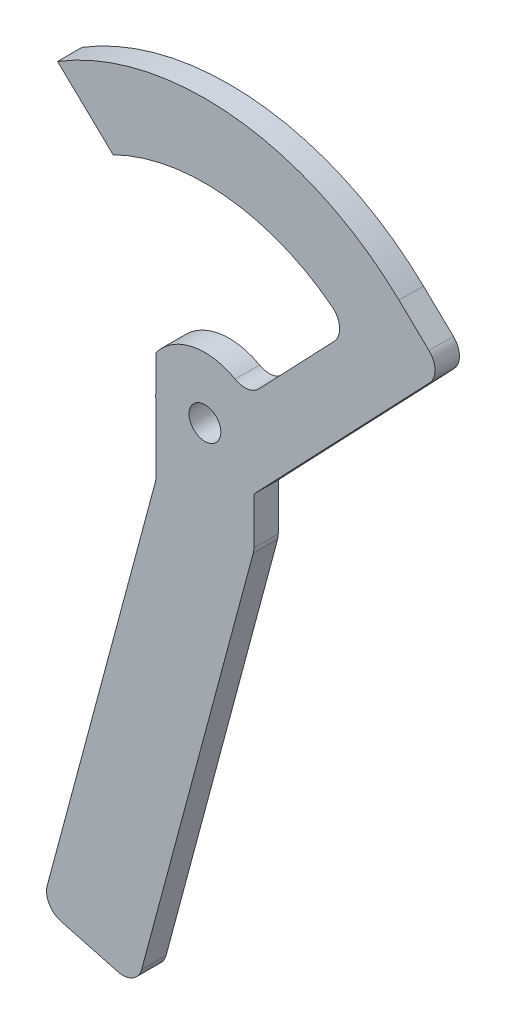
ISO-10303-21;
HEADER;
FILE_DESCRIPTION(('STEP AP214'),'2;1');
FILE_NAME('part.step','',(''),(''),'','','');
FILE_SCHEMA(('AUTOMOTIVE_DESIGN { 1 0 10303 214 1 1 1 1 }'));
ENDSEC;
DATA;
#1=APPLICATION_CONTEXT('core data for automotive mechanical design processes');
#2=APPLICATION_PROTOCOL_DEFINITION('international standard','automotive_design',2000,#1);
#3=PRODUCT_CONTEXT('',#1,'mechanical');
#4=PRODUCT('Part','Part','',(#3));
#5=PRODUCT_RELATED_PRODUCT_CATEGORY('part','',(#4));
#6=PRODUCT_DEFINITION_FORMATION('','',#4);
#7=PRODUCT_DEFINITION_CONTEXT('part definition',#1,'design');
#8=PRODUCT_DEFINITION('design','',#6,#7);
#9=PRODUCT_DEFINITION_SHAPE('','',#8);
#10=(LENGTH_UNIT() NAMED_UNIT(*) SI_UNIT(.MILLI.,.METRE.));
#11=(NAMED_UNIT(*) PLANE_ANGLE_UNIT() SI_UNIT($,.RADIAN.));
#12=(NAMED_UNIT(*) SI_UNIT($,.STERADIAN.) SOLID_ANGLE_UNIT());
#13=UNCERTAINTY_MEASURE_WITH_UNIT(LENGTH_MEASURE(1.E-05),#10,'distance_accuracy_value','');
#14=(GEOMETRIC_REPRESENTATION_CONTEXT(3) GLOBAL_UNCERTAINTY_ASSIGNED_CONTEXT((#13)) GLOBAL_UNIT_ASSIGNED_CONTEXT((#10,
#11,#12)) REPRESENTATION_CONTEXT('',''));
#15=CARTESIAN_POINT('',(0.,0.,0.));
#16=DIRECTION('',(0.,0.,1.));
#17=DIRECTION('',(1.,0.,0.));
#18=AXIS2_PLACEMENT_3D('',#15,#16,#17);
#19=CARTESIAN_POINT('',(0.,0.,5.));
#20=DIRECTION('',(0.,0.,1.));
#21=DIRECTION('',(1.,0.,0.));
#22=AXIS2_PLACEMENT_3D('',#19,#20,#21);
#23=PLANE('',#22);
#24=DIRECTION('',(0.,-1.,0.));
#25=VECTOR('',#24,1.);
#26=CARTESIAN_POINT('',(294.71531691805,0.,5.));
#27=LINE('',#26,#25);
#28=CARTESIAN_POINT('',(294.71531691805,230.119674969828,5.));
#29=VERTEX_POINT('',#28);
#30=CARTESIAN_POINT('',(294.71531691805,222.972135785085,5.));
#31=VERTEX_POINT('',#30);
#32=EDGE_CURVE('E268',#29,#31,#27,.T.);
#33=ORIENTED_EDGE('',*,*,#32,.T.);
#34=CARTESIAN_POINT('',(296.717620536532,222.427704688054,5.));
#35=DIRECTION('',(0.,0.,1.));
#36=DIRECTION('',(1.,0.,0.));
#37=AXIS2_PLACEMENT_3D('',#34,#35,#36);
#38=CIRCLE('',#37,2.07499999999998);
#39=CARTESIAN_POINT('',(294.643218037577,222.377912396209,5.));
#40=VERTEX_POINT('',#39);
#41=EDGE_CURVE('E216',#31,#40,#38,.T.);
#42=ORIENTED_EDGE('',*,*,#41,.T.);
#43=CARTESIAN_POINT('',(304.715316918032,222.61967496975,5.));
#44=DIRECTION('',(0.,0.,1.));
#45=DIRECTION('',(1.,0.,0.));
#46=AXIS2_PLACEMENT_3D('',#43,#44,#45);
#47=CIRCLE('',#46,10.074999999985);
#48=CARTESIAN_POINT('',(294.71531691805,221.392635850547,5.));
#49=VERTEX_POINT('',#48);
#50=EDGE_CURVE('E232',#40,#49,#47,.T.);
#51=ORIENTED_EDGE('',*,*,#50,.T.);
#52=CARTESIAN_POINT('',(294.71531691805,208.1462849601,5.));
#53=VERTEX_POINT('',#52);
#54=EDGE_CURVE('E263',#49,#53,#27,.T.);
#55=ORIENTED_EDGE('',*,*,#54,.T.);
#56=CARTESIAN_POINT('',(290.71531691805,208.146284960133,5.));
#57=DIRECTION('',(0.,0.,1.));
#58=DIRECTION('',(1.,0.,0.));
#59=AXIS2_PLACEMENT_3D('',#56,#57,#58);
#60=CIRCLE('',#59,4.00000000000006);
#61=CARTESIAN_POINT('',(294.5790202232,207.1110087797,5.));
#62=VERTEX_POINT('',#61);
#63=EDGE_CURVE('E271',#62,#53,#60,.T.);
#64=ORIENTED_EDGE('',*,*,#63,.F.);
#65=DIRECTION('',(-0.258819045102268,-0.965925826289136,0.));
#66=VECTOR('',#65,1.);
#67=CARTESIAN_POINT('',(223.068215384371,-59.7709481692314,5.));
#68=LINE('',#67,#66);
#69=CARTESIAN_POINT('',(272.45687903925,124.5500539089,5.));
#70=VERTEX_POINT('',#69);
#71=EDGE_CURVE('E277',#62,#70,#68,.T.);
#72=ORIENTED_EDGE('',*,*,#71,.T.);
#73=CARTESIAN_POINT('',(276.320582344411,123.514777728506,5.));
#74=DIRECTION('',(0.,0.,1.));
#75=DIRECTION('',(1.,0.,0.));
#76=AXIS2_PLACEMENT_3D('',#73,#74,#75);
#77=CIRCLE('',#76,4.);
#78=CARTESIAN_POINT('',(275.285306164,119.65107442335,5.));
#79=VERTEX_POINT('',#78);
#80=EDGE_CURVE('E280',#70,#79,#77,.T.);
#81=ORIENTED_EDGE('',*,*,#80,.T.);
#82=DIRECTION('',(0.965925826288552,-0.258819045104448,0.));
#83=VECTOR('',#82,1.);
#84=CARTESIAN_POINT('',(48.3533874750185,180.457298773393,5.));
#85=LINE('',#84,#83);
#86=CARTESIAN_POINT('',(286.87641607945,116.5452458821,5.));
#87=VERTEX_POINT('',#86);
#88=EDGE_CURVE('E283',#79,#87,#85,.T.);
#89=ORIENTED_EDGE('',*,*,#88,.T.);
#90=CARTESIAN_POINT('',(287.911692259844,120.408949187261,5.));
#91=DIRECTION('',(0.,0.,1.));
#92=DIRECTION('',(1.,0.,0.));
#93=AXIS2_PLACEMENT_3D('',#90,#91,#92);
#94=CIRCLE('',#93,4.00000000000005);
#95=CARTESIAN_POINT('',(291.775395565,119.37367300685,5.));
#96=VERTEX_POINT('',#95);
#97=EDGE_CURVE('E286',#87,#96,#94,.T.);
#98=ORIENTED_EDGE('',*,*,#97,.T.);
#99=DIRECTION('',(0.258819045102614,0.965925826289043,0.));
#100=VECTOR('',#99,1.);
#101=CARTESIAN_POINT('',(242.386731910035,-64.9473290713381,5.));
#102=LINE('',#101,#100);
#103=CARTESIAN_POINT('',(314.5790202232,204.47795882795,5.));
#104=VERTEX_POINT('',#103);
#105=EDGE_CURVE('E289',#96,#104,#102,.T.);
#106=ORIENTED_EDGE('',*,*,#105,.T.);
#107=CARTESIAN_POINT('',(310.71531691805,205.513235008383,5.));
#108=DIRECTION('',(0.,0.,1.));
#109=DIRECTION('',(1.,0.,0.));
#110=AXIS2_PLACEMENT_3D('',#107,#108,#109);
#111=CIRCLE('',#110,4.00000000000006);
#112=CARTESIAN_POINT('',(314.71531691805,205.51323500835,5.));
#113=VERTEX_POINT('',#112);
#114=EDGE_CURVE('E292',#104,#113,#111,.T.);
#115=ORIENTED_EDGE('',*,*,#114,.T.);
#116=DIRECTION('',(0.,1.,0.));
#117=VECTOR('',#116,1.);
#118=CARTESIAN_POINT('',(314.71531691805,0.,5.));
#119=LINE('',#118,#117);
#120=CARTESIAN_POINT('',(314.71531691805,215.050784150237,5.));
#121=VERTEX_POINT('',#120);
#122=EDGE_CURVE('E295',#113,#121,#119,.T.);
#123=ORIENTED_EDGE('',*,*,#122,.T.);
#124=DIRECTION('',(-0.690351786211614,-0.723473849751623,0.));
#125=VECTOR('',#124,1.);
#126=CARTESIAN_POINT('',(57.3191032480149,-54.694921350509,5.));
#127=LINE('',#126,#125);
#128=CARTESIAN_POINT('',(350.6635751972,252.7237869997,5.));
#129=VERTEX_POINT('',#128);
#130=EDGE_CURVE('E298',#129,#121,#127,.T.);
#131=ORIENTED_EDGE('',*,*,#130,.F.);
#132=CARTESIAN_POINT('',(347.769679798222,255.485194144576,5.));
#133=DIRECTION('',(0.,0.,1.));
#134=DIRECTION('',(1.,0.,0.));
#135=AXIS2_PLACEMENT_3D('',#132,#133,#134);
#136=CIRCLE('',#135,4.00000000000002);
#137=CARTESIAN_POINT('',(350.53108694305,258.3790895436,5.));
#138=VERTEX_POINT('',#137);
#139=EDGE_CURVE('E301',#129,#138,#136,.T.);
#140=ORIENTED_EDGE('',*,*,#139,.T.);
#141=DIRECTION('',(0.723473849753081,-0.690351786210086,0.));
#142=VECTOR('',#141,1.);
#143=CARTESIAN_POINT('',(296.105879093295,310.312603749755,5.));
#144=LINE('',#143,#142);
#145=CARTESIAN_POINT('',(344.41054462525,264.21942133045,5.));
#146=VERTEX_POINT('',#145);
#147=EDGE_CURVE('E304',#146,#138,#144,.T.);
#148=ORIENTED_EDGE('',*,*,#147,.F.);
#149=CARTESIAN_POINT('',(304.715316918032,222.61967496975,5.));
#150=DIRECTION('',(0.,0.,1.));
#151=DIRECTION('',(1.,0.,0.));
#152=AXIS2_PLACEMENT_3D('',#149,#150,#151);
#153=CIRCLE('',#152,57.4999999999941);
#154=CARTESIAN_POINT('',(274.5744155729,271.58676663445,5.));
#155=VERTEX_POINT('',#154);
#156=EDGE_CURVE('E307',#146,#155,#153,.T.);
#157=ORIENTED_EDGE('',*,*,#156,.T.);
#158=DIRECTION('',(-0.723473849751925,0.690351786211298,0.));
#159=VECTOR('',#158,1.);
#160=CARTESIAN_POINT('',(266.50261781641,279.289021527339,5.));
#161=LINE('',#160,#159);
#162=CARTESIAN_POINT('',(285.93580897465,260.74552029025,5.));
#163=VERTEX_POINT('',#162);
#164=EDGE_CURVE('E310',#163,#155,#161,.T.);
#165=ORIENTED_EDGE('',*,*,#164,.F.);
#166=CARTESIAN_POINT('',(304.715316918032,222.61967496975,5.));
#167=DIRECTION('',(0.,0.,1.));
#168=DIRECTION('',(1.,0.,0.));
#169=AXIS2_PLACEMENT_3D('',#166,#167,#168);
#170=CIRCLE('',#169,42.4999999999955);
#171=CARTESIAN_POINT('',(330.701924731899,256.249218741993,5.));
#172=VERTEX_POINT('',#171);
#173=EDGE_CURVE('E313',#172,#163,#170,.T.);
#174=ORIENTED_EDGE('',*,*,#173,.F.);
#175=CARTESIAN_POINT('',(328.256126349428,253.084085210481,5.));
#176=DIRECTION('',(0.,0.,1.));
#177=DIRECTION('',(1.,0.,0.));
#178=AXIS2_PLACEMENT_3D('',#175,#176,#177);
#179=CIRCLE('',#178,4.00000000000002);
#180=CARTESIAN_POINT('',(331.15002174845,250.32267806565,5.));
#181=VERTEX_POINT('',#180);
#182=EDGE_CURVE('E316',#181,#172,#179,.T.);
#183=ORIENTED_EDGE('',*,*,#182,.F.);
#184=DIRECTION('',(0.690351786211743,0.7234738497515,0.));
#185=VECTOR('',#184,1.);
#186=CARTESIAN_POINT('',(48.3046655311277,-46.0931824187273,5.));
#187=LINE('',#186,#185);
#188=CARTESIAN_POINT('',(315.7663375547,234.200907326,5.));
#189=VERTEX_POINT('',#188);
#190=EDGE_CURVE('E319',#189,#181,#187,.T.);
#191=ORIENTED_EDGE('',*,*,#190,.F.);
#192=CARTESIAN_POINT('',(312.87244215568,236.962314470833,5.));
#193=DIRECTION('',(0.,0.,1.));
#194=DIRECTION('',(1.,0.,0.));
#195=AXIS2_PLACEMENT_3D('',#192,#193,#194);
#196=CIRCLE('',#195,4.00000000000001);
#197=CARTESIAN_POINT('',(310.89495724957,233.485310955446,5.));
#198=VERTEX_POINT('',#197);
#199=EDGE_CURVE('E322',#198,#189,#196,.T.);
#200=ORIENTED_EDGE('',*,*,#199,.F.);
#201=CARTESIAN_POINT('',(304.715316918032,222.61967496975,5.));
#202=DIRECTION('',(0.,0.,1.));
#203=DIRECTION('',(1.,0.,0.));
#204=AXIS2_PLACEMENT_3D('',#201,#202,#203);
#205=CIRCLE('',#204,12.5000000000329);
#206=EDGE_CURVE('E269',#198,#29,#205,.T.);
#207=ORIENTED_EDGE('',*,*,#206,.T.);
#208=EDGE_LOOP('',(#33,#42,#51,#55,#64,#72,#81,#89,#98,#106,#115,#123,#131,#140,#148,#157,#165,
#174,#183,#191,#200,#207));
#209=FACE_BOUND('',#208,.T.);
#210=CARTESIAN_POINT('',(304.715316918032,222.61967496975,5.));
#211=DIRECTION('',(0.,0.,1.));
#212=DIRECTION('',(1.,0.,0.));
#213=AXIS2_PLACEMENT_3D('',#210,#211,#212);
#214=CIRCLE('',#213,3.25000000001779);
#215=CARTESIAN_POINT('',(307.96531691805,222.61967496975,5.));
#216=VERTEX_POINT('',#215);
#217=EDGE_CURVE('E325',#216,#216,#214,.T.);
#218=ORIENTED_EDGE('',*,*,#217,.F.);
#219=EDGE_LOOP('',(#218));
#220=FACE_BOUND('',#219,.T.);
#221=ADVANCED_FACE('F188',(#209,#220),#23,.T.);
#222=CARTESIAN_POINT('',(304.715316918032,222.61967496975,5.));
#223=DIRECTION('',(0.,0.,-1.));
#224=DIRECTION('',(-1.,0.,0.));
#225=AXIS2_PLACEMENT_3D('',#222,#223,#224);
#226=CYLINDRICAL_SURFACE('',#225,3.25000000001779);
#227=ORIENTED_EDGE('',*,*,#217,.T.);
#228=EDGE_LOOP('',(#227));
#229=FACE_BOUND('',#228,.T.);
#230=CARTESIAN_POINT('',(304.715316918032,222.61967496975,0.));
#231=DIRECTION('',(0.,0.,1.));
#232=DIRECTION('',(1.,0.,0.));
#233=AXIS2_PLACEMENT_3D('',#230,#231,#232);
#234=CIRCLE('',#233,3.25000000001779);
#235=CARTESIAN_POINT('',(307.96531691805,222.61967496975,0.));
#236=VERTEX_POINT('',#235);
#237=EDGE_CURVE('E273',#236,#236,#234,.T.);
#238=ORIENTED_EDGE('',*,*,#237,.F.);
#239=EDGE_LOOP('',(#238));
#240=FACE_BOUND('',#239,.T.);
#241=ADVANCED_FACE('F601',(#229,#240),#226,.F.);
#242=CARTESIAN_POINT('',(290.71531691805,208.146284960133,5.));
#243=DIRECTION('',(0.,0.,-1.));
#244=DIRECTION('',(-1.,0.,0.));
#245=AXIS2_PLACEMENT_3D('',#242,#243,#244);
#246=CYLINDRICAL_SURFACE('',#245,4.00000000000006);
#247=CARTESIAN_POINT('',(290.71531691805,208.146284960133,0.));
#248=DIRECTION('',(0.,0.,1.));
#249=DIRECTION('',(1.,0.,0.));
#250=AXIS2_PLACEMENT_3D('',#247,#248,#249);
#251=CIRCLE('',#250,4.00000000000006);
#252=CARTESIAN_POINT('',(294.5790202232,207.1110087797,0.));
#253=VERTEX_POINT('',#252);
#254=CARTESIAN_POINT('',(294.71531691805,208.1462849601,0.));
#255=VERTEX_POINT('',#254);
#256=EDGE_CURVE('E332',#253,#255,#251,.T.);
#257=ORIENTED_EDGE('',*,*,#256,.F.);
#258=DIRECTION('',(0.,0.,-1.));
#259=VECTOR('',#258,1.);
#260=CARTESIAN_POINT('',(294.5790202232,207.1110087797,5.));
#261=LINE('',#260,#259);
#262=EDGE_CURVE('E255',#62,#253,#261,.T.);
#263=ORIENTED_EDGE('',*,*,#262,.F.);
#264=ORIENTED_EDGE('',*,*,#63,.T.);
#265=DIRECTION('',(0.,0.,-1.));
#266=VECTOR('',#265,1.);
#267=CARTESIAN_POINT('',(294.71531691805,208.1462849601,5.));
#268=LINE('',#267,#266);
#269=EDGE_CURVE('E248',#53,#255,#268,.T.);
#270=ORIENTED_EDGE('',*,*,#269,.T.);
#271=EDGE_LOOP('',(#257,#263,#264,#270));
#272=FACE_BOUND('',#271,.T.);
#273=ADVANCED_FACE('F445',(#272),#246,.F.);
#274=CARTESIAN_POINT('',(223.068215384371,-59.7709481692314,5.));
#275=DIRECTION('',(0.965925826289136,-0.258819045102268,0.));
#276=DIRECTION('',(0.258819045102268,0.965925826289136,0.));
#277=AXIS2_PLACEMENT_3D('',#274,#275,#276);
#278=PLANE('',#277);
#279=DIRECTION('',(-0.258819045102268,-0.965925826289136,0.));
#280=VECTOR('',#279,1.);
#281=CARTESIAN_POINT('',(223.068215384371,-59.7709481692314,0.));
#282=LINE('',#281,#280);
#283=CARTESIAN_POINT('',(272.45687903925,124.5500539089,0.));
#284=VERTEX_POINT('',#283);
#285=EDGE_CURVE('E334',#253,#284,#282,.T.);
#286=ORIENTED_EDGE('',*,*,#285,.T.);
#287=DIRECTION('',(0.,0.,-1.));
#288=VECTOR('',#287,1.);
#289=CARTESIAN_POINT('',(272.45687903925,124.5500539089,5.));
#290=LINE('',#289,#288);
#291=EDGE_CURVE('E428',#70,#284,#290,.T.);
#292=ORIENTED_EDGE('',*,*,#291,.F.);
#293=ORIENTED_EDGE('',*,*,#71,.F.);
#294=ORIENTED_EDGE('',*,*,#262,.T.);
#295=EDGE_LOOP('',(#286,#292,#293,#294));
#296=FACE_BOUND('',#295,.T.);
#297=ADVANCED_FACE('F436',(#296),#278,.F.);
#298=CARTESIAN_POINT('',(276.320582344411,123.514777728506,5.));
#299=DIRECTION('',(0.,0.,-1.));
#300=DIRECTION('',(-1.,0.,0.));
#301=AXIS2_PLACEMENT_3D('',#298,#299,#300);
#302=CYLINDRICAL_SURFACE('',#301,4.);
#303=CARTESIAN_POINT('',(276.320582344411,123.514777728506,0.));
#304=DIRECTION('',(0.,0.,1.));
#305=DIRECTION('',(1.,0.,0.));
#306=AXIS2_PLACEMENT_3D('',#303,#304,#305);
#307=CIRCLE('',#306,4.);
#308=CARTESIAN_POINT('',(275.285306164,119.65107442335,0.));
#309=VERTEX_POINT('',#308);
#310=EDGE_CURVE('E337',#284,#309,#307,.T.);
#311=ORIENTED_EDGE('',*,*,#310,.T.);
#312=DIRECTION('',(0.,0.,-1.));
#313=VECTOR('',#312,1.);
#314=CARTESIAN_POINT('',(275.285306164,119.65107442335,5.));
#315=LINE('',#314,#313);
#316=EDGE_CURVE('E425',#79,#309,#315,.T.);
#317=ORIENTED_EDGE('',*,*,#316,.F.);
#318=ORIENTED_EDGE('',*,*,#80,.F.);
#319=ORIENTED_EDGE('',*,*,#291,.T.);
#320=EDGE_LOOP('',(#311,#317,#318,#319));
#321=FACE_BOUND('',#320,.T.);
#322=ADVANCED_FACE('F591',(#321),#302,.T.);
#323=CARTESIAN_POINT('',(48.3533874750185,180.457298773393,5.));
#324=DIRECTION('',(0.258819045104448,0.965925826288552,0.));
#325=DIRECTION('',(-0.965925826288552,0.258819045104448,0.));
#326=AXIS2_PLACEMENT_3D('',#323,#324,#325);
#327=PLANE('',#326);
#328=DIRECTION('',(0.965925826288552,-0.258819045104448,0.));
#329=VECTOR('',#328,1.);
#330=CARTESIAN_POINT('',(48.3533874750185,180.457298773393,0.));
#331=LINE('',#330,#329);
#332=CARTESIAN_POINT('',(286.87641607945,116.5452458821,0.));
#333=VERTEX_POINT('',#332);
#334=EDGE_CURVE('E340',#309,#333,#331,.T.);
#335=ORIENTED_EDGE('',*,*,#334,.T.);
#336=DIRECTION('',(0.,0.,-1.));
#337=VECTOR('',#336,1.);
#338=CARTESIAN_POINT('',(286.87641607945,116.5452458821,5.));
#339=LINE('',#338,#337);
#340=EDGE_CURVE('E422',#87,#333,#339,.T.);
#341=ORIENTED_EDGE('',*,*,#340,.F.);
#342=ORIENTED_EDGE('',*,*,#88,.F.);
#343=ORIENTED_EDGE('',*,*,#316,.T.);
#344=EDGE_LOOP('',(#335,#341,#342,#343));
#345=FACE_BOUND('',#344,.T.);
#346=ADVANCED_FACE('F586',(#345),#327,.F.);
#347=CARTESIAN_POINT('',(287.911692259844,120.408949187261,5.));
#348=DIRECTION('',(0.,0.,-1.));
#349=DIRECTION('',(-1.,0.,0.));
#350=AXIS2_PLACEMENT_3D('',#347,#348,#349);
#351=CYLINDRICAL_SURFACE('',#350,4.00000000000005);
#352=CARTESIAN_POINT('',(287.911692259844,120.408949187261,0.));
#353=DIRECTION('',(0.,0.,1.));
#354=DIRECTION('',(1.,0.,0.));
#355=AXIS2_PLACEMENT_3D('',#352,#353,#354);
#356=CIRCLE('',#355,4.00000000000005);
#357=CARTESIAN_POINT('',(291.775395565,119.37367300685,0.));
#358=VERTEX_POINT('',#357);
#359=EDGE_CURVE('E343',#333,#358,#356,.T.);
#360=ORIENTED_EDGE('',*,*,#359,.T.);
#361=DIRECTION('',(0.,0.,-1.));
#362=VECTOR('',#361,1.);
#363=CARTESIAN_POINT('',(291.775395565,119.37367300685,5.));
#364=LINE('',#363,#362);
#365=EDGE_CURVE('E419',#96,#358,#364,.T.);
#366=ORIENTED_EDGE('',*,*,#365,.F.);
#367=ORIENTED_EDGE('',*,*,#97,.F.);
#368=ORIENTED_EDGE('',*,*,#340,.T.);
#369=EDGE_LOOP('',(#360,#366,#367,#368));
#370=FACE_BOUND('',#369,.T.);
#371=ADVANCED_FACE('F583',(#370),#351,.T.);
#372=CARTESIAN_POINT('',(242.386731910035,-64.9473290713381,5.));
#373=DIRECTION('',(-0.965925826289043,0.258819045102614,0.));
#374=DIRECTION('',(-0.258819045102614,-0.965925826289043,0.));
#375=AXIS2_PLACEMENT_3D('',#372,#373,#374);
#376=PLANE('',#375);
#377=DIRECTION('',(0.258819045102614,0.965925826289043,0.));
#378=VECTOR('',#377,1.);
#379=CARTESIAN_POINT('',(242.386731910035,-64.9473290713381,0.));
#380=LINE('',#379,#378);
#381=CARTESIAN_POINT('',(314.5790202232,204.47795882795,0.));
#382=VERTEX_POINT('',#381);
#383=EDGE_CURVE('E346',#358,#382,#380,.T.);
#384=ORIENTED_EDGE('',*,*,#383,.T.);
#385=DIRECTION('',(0.,0.,-1.));
#386=VECTOR('',#385,1.);
#387=CARTESIAN_POINT('',(314.5790202232,204.47795882795,5.));
#388=LINE('',#387,#386);
#389=EDGE_CURVE('E416',#104,#382,#388,.T.);
#390=ORIENTED_EDGE('',*,*,#389,.F.);
#391=ORIENTED_EDGE('',*,*,#105,.F.);
#392=ORIENTED_EDGE('',*,*,#365,.T.);
#393=EDGE_LOOP('',(#384,#390,#391,#392));
#394=FACE_BOUND('',#393,.T.);
#395=ADVANCED_FACE('F579',(#394),#376,.F.);
#396=CARTESIAN_POINT('',(310.71531691805,205.513235008383,5.));
#397=DIRECTION('',(0.,0.,-1.));
#398=DIRECTION('',(-1.,0.,0.));
#399=AXIS2_PLACEMENT_3D('',#396,#397,#398);
#400=CYLINDRICAL_SURFACE('',#399,4.00000000000006);
#401=CARTESIAN_POINT('',(310.71531691805,205.513235008383,0.));
#402=DIRECTION('',(0.,0.,1.));
#403=DIRECTION('',(1.,0.,0.));
#404=AXIS2_PLACEMENT_3D('',#401,#402,#403);
#405=CIRCLE('',#404,4.00000000000006);
#406=CARTESIAN_POINT('',(314.71531691805,205.51323500835,0.));
#407=VERTEX_POINT('',#406);
#408=EDGE_CURVE('E349',#382,#407,#405,.T.);
#409=ORIENTED_EDGE('',*,*,#408,.T.);
#410=DIRECTION('',(0.,0.,-1.));
#411=VECTOR('',#410,1.);
#412=CARTESIAN_POINT('',(314.71531691805,205.51323500835,5.));
#413=LINE('',#412,#411);
#414=EDGE_CURVE('E413',#113,#407,#413,.T.);
#415=ORIENTED_EDGE('',*,*,#414,.F.);
#416=ORIENTED_EDGE('',*,*,#114,.F.);
#417=ORIENTED_EDGE('',*,*,#389,.T.);
#418=EDGE_LOOP('',(#409,#415,#416,#417));
#419=FACE_BOUND('',#418,.T.);
#420=ADVANCED_FACE('F574',(#419),#400,.T.);
#421=CARTESIAN_POINT('',(314.71531691805,0.,5.));
#422=DIRECTION('',(-1.,0.,0.));
#423=DIRECTION('',(0.,0.,1.));
#424=AXIS2_PLACEMENT_3D('',#421,#422,#423);
#425=PLANE('',#424);
#426=DIRECTION('',(0.,1.,0.));
#427=VECTOR('',#426,1.);
#428=CARTESIAN_POINT('',(314.71531691805,0.,0.));
#429=LINE('',#428,#427);
#430=CARTESIAN_POINT('',(314.71531691805,215.050784150237,0.));
#431=VERTEX_POINT('',#430);
#432=EDGE_CURVE('E352',#407,#431,#429,.T.);
#433=ORIENTED_EDGE('',*,*,#432,.T.);
#434=DIRECTION('',(0.,0.,-1.));
#435=VECTOR('',#434,1.);
#436=CARTESIAN_POINT('',(314.71531691805,215.050784150237,5.));
#437=LINE('',#436,#435);
#438=EDGE_CURVE('E410',#121,#431,#437,.T.);
#439=ORIENTED_EDGE('',*,*,#438,.F.);
#440=ORIENTED_EDGE('',*,*,#122,.F.);
#441=ORIENTED_EDGE('',*,*,#414,.T.);
#442=EDGE_LOOP('',(#433,#439,#440,#441));
#443=FACE_BOUND('',#442,.T.);
#444=ADVANCED_FACE('F568',(#443),#425,.F.);
#445=CARTESIAN_POINT('',(57.3191032480149,-54.694921350509,5.));
#446=DIRECTION('',(0.723473849751623,-0.690351786211614,0.));
#447=DIRECTION('',(0.690351786211614,0.723473849751623,0.));
#448=AXIS2_PLACEMENT_3D('',#445,#446,#447);
#449=PLANE('',#448);
#450=DIRECTION('',(-0.690351786211614,-0.723473849751623,0.));
#451=VECTOR('',#450,1.);
#452=CARTESIAN_POINT('',(57.3191032480149,-54.694921350509,0.));
#453=LINE('',#452,#451);
#454=CARTESIAN_POINT('',(350.6635751972,252.7237869997,0.));
#455=VERTEX_POINT('',#454);
#456=EDGE_CURVE('E355',#455,#431,#453,.T.);
#457=ORIENTED_EDGE('',*,*,#456,.F.);
#458=DIRECTION('',(0.,0.,-1.));
#459=VECTOR('',#458,1.);
#460=CARTESIAN_POINT('',(350.6635751972,252.7237869997,5.));
#461=LINE('',#460,#459);
#462=EDGE_CURVE('E407',#129,#455,#461,.T.);
#463=ORIENTED_EDGE('',*,*,#462,.F.);
#464=ORIENTED_EDGE('',*,*,#130,.T.);
#465=ORIENTED_EDGE('',*,*,#438,.T.);
#466=EDGE_LOOP('',(#457,#463,#464,#465));
#467=FACE_BOUND('',#466,.T.);
#468=ADVANCED_FACE('F563',(#467),#449,.T.);
#469=CARTESIAN_POINT('',(347.769679798222,255.485194144576,5.));
#470=DIRECTION('',(0.,0.,-1.));
#471=DIRECTION('',(-1.,0.,0.));
#472=AXIS2_PLACEMENT_3D('',#469,#470,#471);
#473=CYLINDRICAL_SURFACE('',#472,4.00000000000002);
#474=CARTESIAN_POINT('',(347.769679798222,255.485194144576,0.));
#475=DIRECTION('',(0.,0.,1.));
#476=DIRECTION('',(1.,0.,0.));
#477=AXIS2_PLACEMENT_3D('',#474,#475,#476);
#478=CIRCLE('',#477,4.00000000000002);
#479=CARTESIAN_POINT('',(350.53108694305,258.3790895436,0.));
#480=VERTEX_POINT('',#479);
#481=EDGE_CURVE('E358',#455,#480,#478,.T.);
#482=ORIENTED_EDGE('',*,*,#481,.T.);
#483=DIRECTION('',(0.,0.,-1.));
#484=VECTOR('',#483,1.);
#485=CARTESIAN_POINT('',(350.53108694305,258.3790895436,5.));
#486=LINE('',#485,#484);
#487=EDGE_CURVE('E404',#138,#480,#486,.T.);
#488=ORIENTED_EDGE('',*,*,#487,.F.);
#489=ORIENTED_EDGE('',*,*,#139,.F.);
#490=ORIENTED_EDGE('',*,*,#462,.T.);
#491=EDGE_LOOP('',(#482,#488,#489,#490));
#492=FACE_BOUND('',#491,.T.);
#493=ADVANCED_FACE('F559',(#492),#473,.T.);
#494=CARTESIAN_POINT('',(296.105879093295,310.312603749755,5.));
#495=DIRECTION('',(0.690351786210086,0.723473849753081,0.));
#496=DIRECTION('',(-0.723473849753081,0.690351786210086,0.));
#497=AXIS2_PLACEMENT_3D('',#494,#495,#496);
#498=PLANE('',#497);
#499=DIRECTION('',(0.723473849753081,-0.690351786210086,0.));
#500=VECTOR('',#499,1.);
#501=CARTESIAN_POINT('',(296.105879093295,310.312603749755,0.));
#502=LINE('',#501,#500);
#503=CARTESIAN_POINT('',(344.41054462525,264.21942133045,0.));
#504=VERTEX_POINT('',#503);
#505=EDGE_CURVE('E361',#504,#480,#502,.T.);
#506=ORIENTED_EDGE('',*,*,#505,.F.);
#507=DIRECTION('',(0.,0.,-1.));
#508=VECTOR('',#507,1.);
#509=CARTESIAN_POINT('',(344.41054462525,264.21942133045,5.));
#510=LINE('',#509,#508);
#511=EDGE_CURVE('E401',#146,#504,#510,.T.);
#512=ORIENTED_EDGE('',*,*,#511,.F.);
#513=ORIENTED_EDGE('',*,*,#147,.T.);
#514=ORIENTED_EDGE('',*,*,#487,.T.);
#515=EDGE_LOOP('',(#506,#512,#513,#514));
#516=FACE_BOUND('',#515,.T.);
#517=ADVANCED_FACE('F553',(#516),#498,.T.);
#518=CARTESIAN_POINT('',(304.715316918032,222.61967496975,5.));
#519=DIRECTION('',(0.,0.,-1.));
#520=DIRECTION('',(-1.,0.,0.));
#521=AXIS2_PLACEMENT_3D('',#518,#519,#520);
#522=CYLINDRICAL_SURFACE('',#521,57.4999999999941);
#523=CARTESIAN_POINT('',(304.715316918032,222.61967496975,0.));
#524=DIRECTION('',(0.,0.,1.));
#525=DIRECTION('',(1.,0.,0.));
#526=AXIS2_PLACEMENT_3D('',#523,#524,#525);
#527=CIRCLE('',#526,57.4999999999941);
#528=CARTESIAN_POINT('',(274.5744155729,271.58676663445,0.));
#529=VERTEX_POINT('',#528);
#530=EDGE_CURVE('E364',#504,#529,#527,.T.);
#531=ORIENTED_EDGE('',*,*,#530,.T.);
#532=DIRECTION('',(0.,0.,-1.));
#533=VECTOR('',#532,1.);
#534=CARTESIAN_POINT('',(274.5744155729,271.58676663445,5.));
#535=LINE('',#534,#533);
#536=EDGE_CURVE('E398',#155,#529,#535,.T.);
#537=ORIENTED_EDGE('',*,*,#536,.F.);
#538=ORIENTED_EDGE('',*,*,#156,.F.);
#539=ORIENTED_EDGE('',*,*,#511,.T.);
#540=EDGE_LOOP('',(#531,#537,#538,#539));
#541=FACE_BOUND('',#540,.T.);
#542=ADVANCED_FACE('F592',(#541),#522,.T.);
#543=CARTESIAN_POINT('',(266.50261781641,279.289021527339,5.));
#544=DIRECTION('',(-0.690351786211298,-0.723473849751925,0.));
#545=DIRECTION('',(0.723473849751925,-0.690351786211298,0.));
#546=AXIS2_PLACEMENT_3D('',#543,#544,#545);
#547=PLANE('',#546);
#548=DIRECTION('',(-0.723473849751925,0.690351786211298,0.));
#549=VECTOR('',#548,1.);
#550=CARTESIAN_POINT('',(266.50261781641,279.289021527339,0.));
#551=LINE('',#550,#549);
#552=CARTESIAN_POINT('',(285.93580897465,260.74552029025,0.));
#553=VERTEX_POINT('',#552);
#554=EDGE_CURVE('E367',#553,#529,#551,.T.);
#555=ORIENTED_EDGE('',*,*,#554,.F.);
#556=DIRECTION('',(0.,0.,-1.));
#557=VECTOR('',#556,1.);
#558=CARTESIAN_POINT('',(285.93580897465,260.74552029025,5.));
#559=LINE('',#558,#557);
#560=EDGE_CURVE('E395',#163,#553,#559,.T.);
#561=ORIENTED_EDGE('',*,*,#560,.F.);
#562=ORIENTED_EDGE('',*,*,#164,.T.);
#563=ORIENTED_EDGE('',*,*,#536,.T.);
#564=EDGE_LOOP('',(#555,#561,#562,#563));
#565=FACE_BOUND('',#564,.T.);
#566=ADVANCED_FACE('F546',(#565),#547,.T.);
#567=CARTESIAN_POINT('',(304.715316918032,222.61967496975,5.));
#568=DIRECTION('',(0.,0.,-1.));
#569=DIRECTION('',(-1.,0.,0.));
#570=AXIS2_PLACEMENT_3D('',#567,#568,#569);
#571=CYLINDRICAL_SURFACE('',#570,42.4999999999955);
#572=CARTESIAN_POINT('',(304.715316918032,222.61967496975,0.));
#573=DIRECTION('',(0.,0.,1.));
#574=DIRECTION('',(1.,0.,0.));
#575=AXIS2_PLACEMENT_3D('',#572,#573,#574);
#576=CIRCLE('',#575,42.4999999999955);
#577=CARTESIAN_POINT('',(330.701924731899,256.249218741993,0.));
#578=VERTEX_POINT('',#577);
#579=EDGE_CURVE('E370',#578,#553,#576,.T.);
#580=ORIENTED_EDGE('',*,*,#579,.F.);
#581=DIRECTION('',(0.,0.,-1.));
#582=VECTOR('',#581,1.);
#583=CARTESIAN_POINT('',(330.701924731899,256.249218741993,5.));
#584=LINE('',#583,#582);
#585=EDGE_CURVE('E392',#172,#578,#584,.T.);
#586=ORIENTED_EDGE('',*,*,#585,.F.);
#587=ORIENTED_EDGE('',*,*,#173,.T.);
#588=ORIENTED_EDGE('',*,*,#560,.T.);
#589=EDGE_LOOP('',(#580,#586,#587,#588));
#590=FACE_BOUND('',#589,.T.);
#591=ADVANCED_FACE('F542',(#590),#571,.F.);
#592=CARTESIAN_POINT('',(328.256126349428,253.084085210481,5.));
#593=DIRECTION('',(0.,0.,-1.));
#594=DIRECTION('',(-1.,0.,0.));
#595=AXIS2_PLACEMENT_3D('',#592,#593,#594);
#596=CYLINDRICAL_SURFACE('',#595,4.00000000000002);
#597=CARTESIAN_POINT('',(328.256126349428,253.084085210481,0.));
#598=DIRECTION('',(0.,0.,1.));
#599=DIRECTION('',(1.,0.,0.));
#600=AXIS2_PLACEMENT_3D('',#597,#598,#599);
#601=CIRCLE('',#600,4.00000000000002);
#602=CARTESIAN_POINT('',(331.15002174845,250.32267806565,0.));
#603=VERTEX_POINT('',#602);
#604=EDGE_CURVE('E373',#603,#578,#601,.T.);
#605=ORIENTED_EDGE('',*,*,#604,.F.);
#606=DIRECTION('',(0.,0.,-1.));
#607=VECTOR('',#606,1.);
#608=CARTESIAN_POINT('',(331.15002174845,250.32267806565,5.));
#609=LINE('',#608,#607);
#610=EDGE_CURVE('E389',#181,#603,#609,.T.);
#611=ORIENTED_EDGE('',*,*,#610,.F.);
#612=ORIENTED_EDGE('',*,*,#182,.T.);
#613=ORIENTED_EDGE('',*,*,#585,.T.);
#614=EDGE_LOOP('',(#605,#611,#612,#613));
#615=FACE_BOUND('',#614,.T.);
#616=ADVANCED_FACE('F538',(#615),#596,.F.);
#617=CARTESIAN_POINT('',(48.3046655311277,-46.0931824187273,5.));
#618=DIRECTION('',(-0.7234738497515,0.690351786211743,0.));
#619=DIRECTION('',(-0.690351786211743,-0.7234738497515,0.));
#620=AXIS2_PLACEMENT_3D('',#617,#618,#619);
#621=PLANE('',#620);
#622=DIRECTION('',(0.690351786211743,0.7234738497515,0.));
#623=VECTOR('',#622,1.);
#624=CARTESIAN_POINT('',(48.3046655311277,-46.0931824187273,0.));
#625=LINE('',#624,#623);
#626=CARTESIAN_POINT('',(315.7663375547,234.200907326,0.));
#627=VERTEX_POINT('',#626);
#628=EDGE_CURVE('E376',#627,#603,#625,.T.);
#629=ORIENTED_EDGE('',*,*,#628,.F.);
#630=DIRECTION('',(0.,0.,-1.));
#631=VECTOR('',#630,1.);
#632=CARTESIAN_POINT('',(315.7663375547,234.200907326,5.));
#633=LINE('',#632,#631);
#634=EDGE_CURVE('E386',#189,#627,#633,.T.);
#635=ORIENTED_EDGE('',*,*,#634,.F.);
#636=ORIENTED_EDGE('',*,*,#190,.T.);
#637=ORIENTED_EDGE('',*,*,#610,.T.);
#638=EDGE_LOOP('',(#629,#635,#636,#637));
#639=FACE_BOUND('',#638,.T.);
#640=ADVANCED_FACE('F534',(#639),#621,.T.);
#641=CARTESIAN_POINT('',(312.87244215568,236.962314470833,5.));
#642=DIRECTION('',(0.,0.,-1.));
#643=DIRECTION('',(-1.,0.,0.));
#644=AXIS2_PLACEMENT_3D('',#641,#642,#643);
#645=CYLINDRICAL_SURFACE('',#644,4.00000000000001);
#646=CARTESIAN_POINT('',(312.87244215568,236.962314470833,0.));
#647=DIRECTION('',(0.,0.,1.));
#648=DIRECTION('',(1.,0.,0.));
#649=AXIS2_PLACEMENT_3D('',#646,#647,#648);
#650=CIRCLE('',#649,4.00000000000001);
#651=CARTESIAN_POINT('',(310.89495724957,233.485310955446,0.));
#652=VERTEX_POINT('',#651);
#653=EDGE_CURVE('E379',#652,#627,#650,.T.);
#654=ORIENTED_EDGE('',*,*,#653,.F.);
#655=DIRECTION('',(0.,0.,-1.));
#656=VECTOR('',#655,1.);
#657=CARTESIAN_POINT('',(310.89495724957,233.485310955446,5.));
#658=LINE('',#657,#656);
#659=EDGE_CURVE('E328',#198,#652,#658,.T.);
#660=ORIENTED_EDGE('',*,*,#659,.F.);
#661=ORIENTED_EDGE('',*,*,#199,.T.);
#662=ORIENTED_EDGE('',*,*,#634,.T.);
#663=EDGE_LOOP('',(#654,#660,#661,#662));
#664=FACE_BOUND('',#663,.T.);
#665=ADVANCED_FACE('F531',(#664),#645,.F.);
#666=CARTESIAN_POINT('',(304.715316918032,222.61967496975,5.));
#667=DIRECTION('',(0.,0.,-1.));
#668=DIRECTION('',(-1.,0.,0.));
#669=AXIS2_PLACEMENT_3D('',#666,#667,#668);
#670=CYLINDRICAL_SURFACE('',#669,12.5000000000329);
#671=CARTESIAN_POINT('',(304.715316918032,222.61967496975,0.));
#672=DIRECTION('',(0.,0.,1.));
#673=DIRECTION('',(1.,0.,0.));
#674=AXIS2_PLACEMENT_3D('',#671,#672,#673);
#675=CIRCLE('',#674,12.5000000000329);
#676=CARTESIAN_POINT('',(294.71531691805,230.119674969828,0.));
#677=VERTEX_POINT('',#676);
#678=EDGE_CURVE('E236',#652,#677,#675,.T.);
#679=ORIENTED_EDGE('',*,*,#678,.T.);
#680=DIRECTION('',(0.,0.,-1.));
#681=VECTOR('',#680,1.);
#682=CARTESIAN_POINT('',(294.71531691805,230.119674969828,5.));
#683=LINE('',#682,#681);
#684=EDGE_CURVE('E246',#29,#677,#683,.T.);
#685=ORIENTED_EDGE('',*,*,#684,.F.);
#686=ORIENTED_EDGE('',*,*,#206,.F.);
#687=ORIENTED_EDGE('',*,*,#659,.T.);
#688=EDGE_LOOP('',(#679,#685,#686,#687));
#689=FACE_BOUND('',#688,.T.);
#690=ADVANCED_FACE('F529',(#689),#670,.T.);
#691=CARTESIAN_POINT('',(294.71531691805,0.,5.));
#692=DIRECTION('',(1.,0.,0.));
#693=DIRECTION('',(0.,0.,-1.));
#694=AXIS2_PLACEMENT_3D('',#691,#692,#693);
#695=PLANE('',#694);
#696=DIRECTION('',(0.,0.,-1.));
#697=VECTOR('',#696,1.);
#698=CARTESIAN_POINT('',(294.71531691805,222.972135785085,5.));
#699=LINE('',#698,#697);
#700=CARTESIAN_POINT('',(294.71531691805,222.972135785085,0.));
#701=VERTEX_POINT('',#700);
#702=EDGE_CURVE('E12',#31,#701,#699,.T.);
#703=ORIENTED_EDGE('',*,*,#702,.F.);
#704=ORIENTED_EDGE('',*,*,#32,.F.);
#705=ORIENTED_EDGE('',*,*,#684,.T.);
#706=DIRECTION('',(0.,-1.,0.));
#707=VECTOR('',#706,1.);
#708=CARTESIAN_POINT('',(294.71531691805,0.,0.));
#709=LINE('',#708,#707);
#710=EDGE_CURVE('E330',#677,#701,#709,.T.);
#711=ORIENTED_EDGE('',*,*,#710,.T.);
#712=EDGE_LOOP('',(#703,#704,#705,#711));
#713=FACE_BOUND('',#712,.T.);
#714=ADVANCED_FACE('F525',(#713),#695,.F.);
#715=DIRECTION('',(0.,0.,-1.));
#716=VECTOR('',#715,1.);
#717=CARTESIAN_POINT('',(294.71531691805,221.392635850547,5.));
#718=LINE('',#717,#716);
#719=CARTESIAN_POINT('',(294.71531691805,221.392635850547,0.));
#720=VERTEX_POINT('',#719);
#721=EDGE_CURVE('E197',#720,#49,#718,.F.);
#722=ORIENTED_EDGE('',*,*,#721,.F.);
#723=EDGE_CURVE('E242',#720,#255,#709,.T.);
#724=ORIENTED_EDGE('',*,*,#723,.T.);
#725=ORIENTED_EDGE('',*,*,#269,.F.);
#726=ORIENTED_EDGE('',*,*,#54,.F.);
#727=EDGE_LOOP('',(#722,#724,#725,#726));
#728=FACE_BOUND('',#727,.T.);
#729=ADVANCED_FACE('F266',(#728),#695,.F.);
#730=CARTESIAN_POINT('',(0.,0.,0.));
#731=DIRECTION('',(0.,0.,1.));
#732=DIRECTION('',(1.,0.,0.));
#733=AXIS2_PLACEMENT_3D('',#730,#731,#732);
#734=PLANE('',#733);
#735=ORIENTED_EDGE('',*,*,#723,.F.);
#736=CARTESIAN_POINT('',(304.715316918032,222.61967496975,0.));
#737=DIRECTION('',(0.,0.,1.));
#738=DIRECTION('',(1.,0.,0.));
#739=AXIS2_PLACEMENT_3D('',#736,#737,#738);
#740=CIRCLE('',#739,10.074999999985);
#741=CARTESIAN_POINT('',(294.643218037577,222.377912396209,0.));
#742=VERTEX_POINT('',#741);
#743=EDGE_CURVE('E233',#742,#720,#740,.T.);
#744=ORIENTED_EDGE('',*,*,#743,.F.);
#745=CARTESIAN_POINT('',(296.717620536532,222.427704688054,0.));
#746=DIRECTION('',(0.,0.,1.));
#747=DIRECTION('',(1.,0.,0.));
#748=AXIS2_PLACEMENT_3D('',#745,#746,#747);
#749=CIRCLE('',#748,2.075);
#750=EDGE_CURVE('E224',#701,#742,#749,.T.);
#751=ORIENTED_EDGE('',*,*,#750,.F.);
#752=ORIENTED_EDGE('',*,*,#710,.F.);
#753=ORIENTED_EDGE('',*,*,#678,.F.);
#754=ORIENTED_EDGE('',*,*,#653,.T.);
#755=ORIENTED_EDGE('',*,*,#628,.T.);
#756=ORIENTED_EDGE('',*,*,#604,.T.);
#757=ORIENTED_EDGE('',*,*,#579,.T.);
#758=ORIENTED_EDGE('',*,*,#554,.T.);
#759=ORIENTED_EDGE('',*,*,#530,.F.);
#760=ORIENTED_EDGE('',*,*,#505,.T.);
#761=ORIENTED_EDGE('',*,*,#481,.F.);
#762=ORIENTED_EDGE('',*,*,#456,.T.);
#763=ORIENTED_EDGE('',*,*,#432,.F.);
#764=ORIENTED_EDGE('',*,*,#408,.F.);
#765=ORIENTED_EDGE('',*,*,#383,.F.);
#766=ORIENTED_EDGE('',*,*,#359,.F.);
#767=ORIENTED_EDGE('',*,*,#334,.F.);
#768=ORIENTED_EDGE('',*,*,#310,.F.);
#769=ORIENTED_EDGE('',*,*,#285,.F.);
#770=ORIENTED_EDGE('',*,*,#256,.T.);
#771=EDGE_LOOP('',(#735,#744,#751,#752,#753,#754,#755,#756,#757,#758,#759,#760,#761,#762,#763,
#764,#765,#766,#767,#768,#769,#770));
#772=FACE_BOUND('',#771,.T.);
#773=ORIENTED_EDGE('',*,*,#237,.T.);
#774=EDGE_LOOP('',(#773));
#775=FACE_BOUND('',#774,.T.);
#776=ADVANCED_FACE('F238',(#772,#775),#734,.F.);
#777=CARTESIAN_POINT('',(304.715316918032,222.61967496975,5.));
#778=DIRECTION('',(0.,0.,-1.));
#779=DIRECTION('',(-1.,0.,0.));
#780=AXIS2_PLACEMENT_3D('',#777,#778,#779);
#781=CYLINDRICAL_SURFACE('',#780,10.074999999985);
#782=ORIENTED_EDGE('',*,*,#743,.T.);
#783=ORIENTED_EDGE('',*,*,#721,.T.);
#784=ORIENTED_EDGE('',*,*,#50,.F.);
#785=DIRECTION('',(0.,0.,-1.));
#786=VECTOR('',#785,1.);
#787=CARTESIAN_POINT('',(294.643218037577,222.377912396209,5.));
#788=LINE('',#787,#786);
#789=EDGE_CURVE('E227',#40,#742,#788,.T.);
#790=ORIENTED_EDGE('',*,*,#789,.T.);
#791=EDGE_LOOP('',(#782,#783,#784,#790));
#792=FACE_BOUND('',#791,.T.);
#793=ADVANCED_FACE('F190',(#792),#781,.T.);
#794=CARTESIAN_POINT('',(296.717620536532,222.427704688054,5.));
#795=DIRECTION('',(0.,0.,-1.));
#796=DIRECTION('',(-1.,0.,0.));
#797=AXIS2_PLACEMENT_3D('',#794,#795,#796);
#798=CYLINDRICAL_SURFACE('',#797,2.075);
#799=ORIENTED_EDGE('',*,*,#41,.F.);
#800=ORIENTED_EDGE('',*,*,#702,.T.);
#801=ORIENTED_EDGE('',*,*,#750,.T.);
#802=ORIENTED_EDGE('',*,*,#789,.F.);
#803=EDGE_LOOP('',(#799,#800,#801,#802));
#804=FACE_BOUND('',#803,.T.);
#805=ADVANCED_FACE('F226',(#804),#798,.T.);
#806=CLOSED_SHELL('',(#221,#241,#273,#297,#322,#346,#371,#395,#420,#444,#468,#493,#517,#542,
#566,#591,#616,#640,#665,#690,#714,#729,#776,#793,#805));
#807=MANIFOLD_SOLID_BREP('B2',#806);
#808=ADVANCED_BREP_SHAPE_REPRESENTATION('',(#18,#807),#14);
#809=SHAPE_DEFINITION_REPRESENTATION(#9,#808);
ENDSEC;
END-ISO-10303-21;
